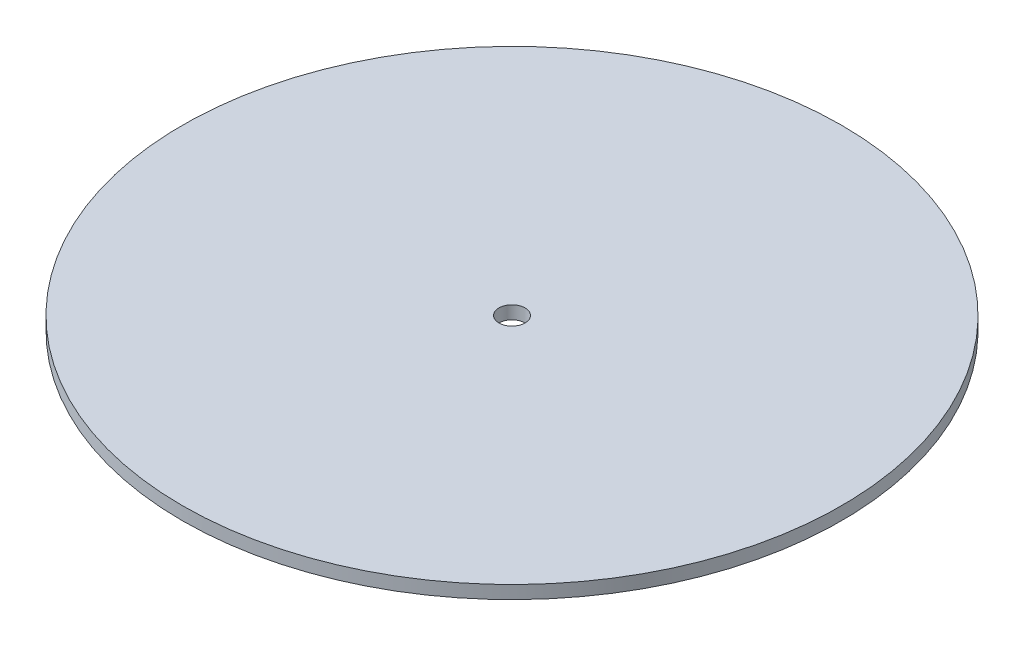
ISO-10303-21;
HEADER;
FILE_DESCRIPTION(('STEP AP214'),'2;1');
FILE_NAME('part.step','',(''),(''),'','','');
FILE_SCHEMA(('AUTOMOTIVE_DESIGN { 1 0 10303 214 1 1 1 1 }'));
ENDSEC;
DATA;
#1=APPLICATION_CONTEXT('core data for automotive mechanical design processes');
#2=APPLICATION_PROTOCOL_DEFINITION('international standard','automotive_design',2000,#1);
#3=PRODUCT_CONTEXT('',#1,'mechanical');
#4=PRODUCT('Part','Part','',(#3));
#5=PRODUCT_RELATED_PRODUCT_CATEGORY('part','',(#4));
#6=PRODUCT_DEFINITION_FORMATION('','',#4);
#7=PRODUCT_DEFINITION_CONTEXT('part definition',#1,'design');
#8=PRODUCT_DEFINITION('design','',#6,#7);
#9=PRODUCT_DEFINITION_SHAPE('','',#8);
#10=(LENGTH_UNIT() NAMED_UNIT(*) SI_UNIT(.MILLI.,.METRE.));
#11=(NAMED_UNIT(*) PLANE_ANGLE_UNIT() SI_UNIT($,.RADIAN.));
#12=(NAMED_UNIT(*) SI_UNIT($,.STERADIAN.) SOLID_ANGLE_UNIT());
#13=UNCERTAINTY_MEASURE_WITH_UNIT(LENGTH_MEASURE(1.E-05),#10,'distance_accuracy_value','');
#14=(GEOMETRIC_REPRESENTATION_CONTEXT(3) GLOBAL_UNCERTAINTY_ASSIGNED_CONTEXT((#13)) GLOBAL_UNIT_ASSIGNED_CONTEXT((#10,
#11,#12)) REPRESENTATION_CONTEXT('',''));
#15=CARTESIAN_POINT('',(0.,0.,0.));
#16=DIRECTION('',(0.,0.,1.));
#17=DIRECTION('',(1.,0.,0.));
#18=AXIS2_PLACEMENT_3D('',#15,#16,#17);
#19=CARTESIAN_POINT('',(0.,5.,0.));
#20=DIRECTION('',(0.,-1.,0.));
#21=DIRECTION('',(0.,0.,-1.));
#22=AXIS2_PLACEMENT_3D('',#19,#20,#21);
#23=CYLINDRICAL_SURFACE('',#22,126.);
#24=CARTESIAN_POINT('',(0.,5.,0.));
#25=DIRECTION('',(0.,1.,0.));
#26=DIRECTION('',(0.,0.,1.));
#27=AXIS2_PLACEMENT_3D('',#24,#25,#26);
#28=CIRCLE('',#27,126.);
#29=CARTESIAN_POINT('',(0.,5.,126.));
#30=VERTEX_POINT('',#29);
#31=EDGE_CURVE('E10',#30,#30,#28,.T.);
#32=ORIENTED_EDGE('',*,*,#31,.F.);
#33=EDGE_LOOP('',(#32));
#34=FACE_BOUND('',#33,.T.);
#35=CARTESIAN_POINT('',(0.,0.,0.));
#36=DIRECTION('',(0.,1.,0.));
#37=DIRECTION('',(0.,0.,1.));
#38=AXIS2_PLACEMENT_3D('',#35,#36,#37);
#39=CIRCLE('',#38,126.);
#40=CARTESIAN_POINT('',(0.,0.,126.));
#41=VERTEX_POINT('',#40);
#42=EDGE_CURVE('E40',#41,#41,#39,.T.);
#43=ORIENTED_EDGE('',*,*,#42,.T.);
#44=EDGE_LOOP('',(#43));
#45=FACE_BOUND('',#44,.T.);
#46=ADVANCED_FACE('F37',(#34,#45),#23,.T.);
#47=CARTESIAN_POINT('',(0.,5.,0.));
#48=DIRECTION('',(0.,1.,0.));
#49=DIRECTION('',(0.,0.,1.));
#50=AXIS2_PLACEMENT_3D('',#47,#48,#49);
#51=PLANE('',#50);
#52=CARTESIAN_POINT('',(0.,5.,0.));
#53=DIRECTION('',(0.,1.,0.));
#54=DIRECTION('',(0.,0.,1.));
#55=AXIS2_PLACEMENT_3D('',#52,#53,#54);
#56=CIRCLE('',#55,5.);
#57=CARTESIAN_POINT('',(0.,5.,5.));
#58=VERTEX_POINT('',#57);
#59=EDGE_CURVE('E51',#58,#58,#56,.T.);
#60=ORIENTED_EDGE('',*,*,#59,.F.);
#61=EDGE_LOOP('',(#60));
#62=FACE_BOUND('',#61,.T.);
#63=ORIENTED_EDGE('',*,*,#31,.T.);
#64=EDGE_LOOP('',(#63));
#65=FACE_BOUND('',#64,.T.);
#66=ADVANCED_FACE('F68',(#62,#65),#51,.T.);
#67=CARTESIAN_POINT('',(0.,0.,0.));
#68=DIRECTION('',(0.,1.,0.));
#69=DIRECTION('',(0.,0.,1.));
#70=AXIS2_PLACEMENT_3D('',#67,#68,#69);
#71=PLANE('',#70);
#72=CARTESIAN_POINT('',(0.,0.,0.));
#73=DIRECTION('',(0.,1.,0.));
#74=DIRECTION('',(0.,0.,1.));
#75=AXIS2_PLACEMENT_3D('',#72,#73,#74);
#76=CIRCLE('',#75,5.);
#77=CARTESIAN_POINT('',(0.,0.,5.));
#78=VERTEX_POINT('',#77);
#79=EDGE_CURVE('E49',#78,#78,#76,.T.);
#80=ORIENTED_EDGE('',*,*,#79,.T.);
#81=EDGE_LOOP('',(#80));
#82=FACE_BOUND('',#81,.T.);
#83=ORIENTED_EDGE('',*,*,#42,.F.);
#84=EDGE_LOOP('',(#83));
#85=FACE_BOUND('',#84,.T.);
#86=ADVANCED_FACE('F59',(#82,#85),#71,.F.);
#87=CARTESIAN_POINT('',(0.,0.,0.));
#88=DIRECTION('',(0.,1.,0.));
#89=DIRECTION('',(0.,0.,1.));
#90=AXIS2_PLACEMENT_3D('',#87,#88,#89);
#91=CYLINDRICAL_SURFACE('',#90,5.);
#92=ORIENTED_EDGE('',*,*,#79,.F.);
#93=EDGE_LOOP('',(#92));
#94=FACE_BOUND('',#93,.T.);
#95=ORIENTED_EDGE('',*,*,#59,.T.);
#96=EDGE_LOOP('',(#95));
#97=FACE_BOUND('',#96,.T.);
#98=ADVANCED_FACE('F62',(#94,#97),#91,.F.);
#99=CLOSED_SHELL('',(#46,#66,#86,#98));
#100=MANIFOLD_SOLID_BREP('B2',#99);
#101=ADVANCED_BREP_SHAPE_REPRESENTATION('',(#18,#100),#14);
#102=SHAPE_DEFINITION_REPRESENTATION(#9,#101);
ENDSEC;
END-ISO-10303-21;
